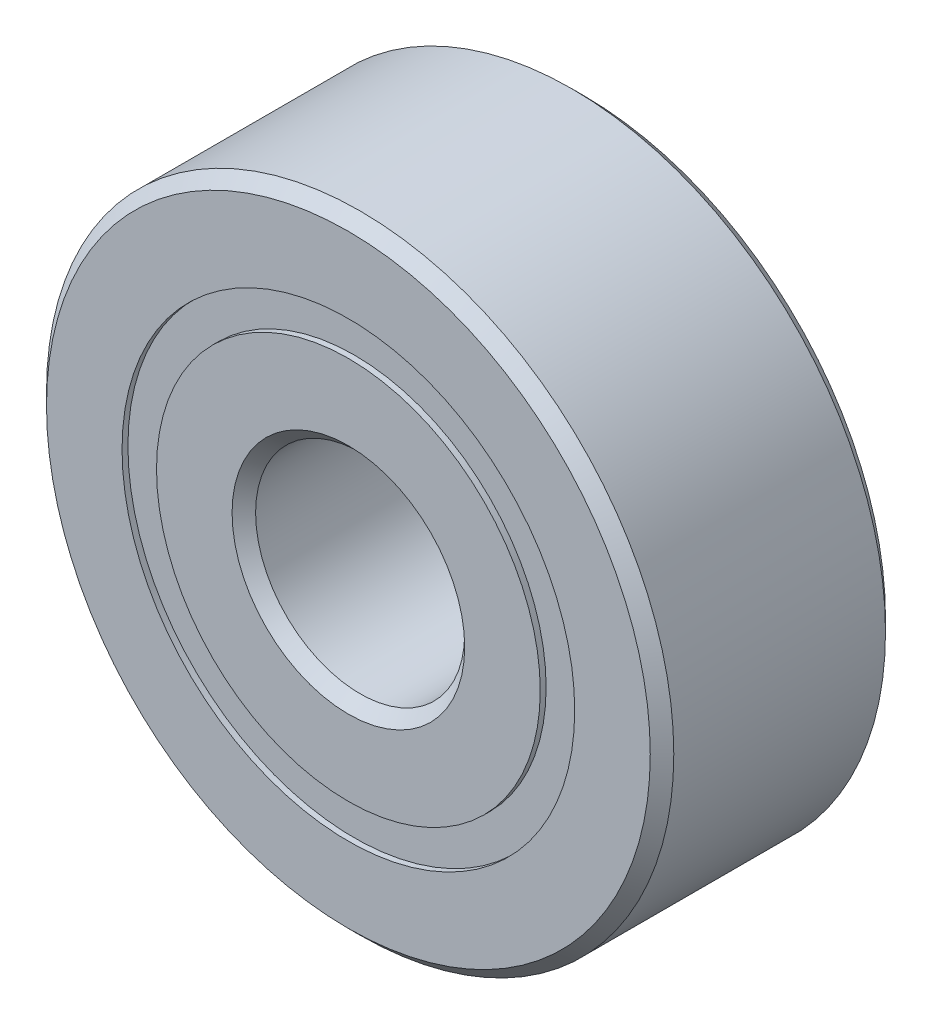
ISO-10303-21;
HEADER;
FILE_DESCRIPTION(('STEP AP214'),'2;1');
FILE_NAME('part.step','',(''),(''),'','','');
FILE_SCHEMA(('AUTOMOTIVE_DESIGN { 1 0 10303 214 1 1 1 1 }'));
ENDSEC;
DATA;
#1=APPLICATION_CONTEXT('core data for automotive mechanical design processes');
#2=APPLICATION_PROTOCOL_DEFINITION('international standard','automotive_design',2000,#1);
#3=PRODUCT_CONTEXT('',#1,'mechanical');
#4=PRODUCT('Part','Part','',(#3));
#5=PRODUCT_RELATED_PRODUCT_CATEGORY('part','',(#4));
#6=PRODUCT_DEFINITION_FORMATION('','',#4);
#7=PRODUCT_DEFINITION_CONTEXT('part definition',#1,'design');
#8=PRODUCT_DEFINITION('design','',#6,#7);
#9=PRODUCT_DEFINITION_SHAPE('','',#8);
#10=(LENGTH_UNIT() NAMED_UNIT(*) SI_UNIT(.MILLI.,.METRE.));
#11=(NAMED_UNIT(*) PLANE_ANGLE_UNIT() SI_UNIT($,.RADIAN.));
#12=(NAMED_UNIT(*) SI_UNIT($,.STERADIAN.) SOLID_ANGLE_UNIT());
#13=UNCERTAINTY_MEASURE_WITH_UNIT(LENGTH_MEASURE(1.E-05),#10,'distance_accuracy_value','');
#14=(GEOMETRIC_REPRESENTATION_CONTEXT(3) GLOBAL_UNCERTAINTY_ASSIGNED_CONTEXT((#13)) GLOBAL_UNIT_ASSIGNED_CONTEXT((#10,
#11,#12)) REPRESENTATION_CONTEXT('',''));
#15=CARTESIAN_POINT('',(0.,0.,0.));
#16=DIRECTION('',(0.,0.,1.));
#17=DIRECTION('',(1.,0.,0.));
#18=AXIS2_PLACEMENT_3D('',#15,#16,#17);
#19=CARTESIAN_POINT('',(0.,6.35,0.));
#20=DIRECTION('',(-1.,0.,0.));
#21=DIRECTION('',(0.,1.,0.));
#22=AXIS2_PLACEMENT_3D('',#19,#20,#21);
#23=SPHERICAL_SURFACE('',#22,1.67154216154795);
#24=CARTESIAN_POINT('',(0.,6.35,0.));
#25=DIRECTION('',(-1.,0.,0.));
#26=DIRECTION('',(0.,1.,0.));
#27=AXIS2_PLACEMENT_3D('',#24,#25,#26);
#28=CIRCLE('',#27,1.67154216154795);
#29=CARTESIAN_POINT('',(0.,5.82664835164835,-1.5875));
#30=VERTEX_POINT('',#29);
#31=CARTESIAN_POINT('',(0.,4.67845783845205,0.));
#32=VERTEX_POINT('',#31);
#33=EDGE_CURVE('P0_E18',#30,#32,#28,.T.);
#34=ORIENTED_EDGE('',*,*,#33,.T.);
#35=CARTESIAN_POINT('',(0.,6.35,0.));
#36=DIRECTION('',(0.,0.,1.));
#37=DIRECTION('',(0.,-1.,0.));
#38=AXIS2_PLACEMENT_3D('',#35,#36,#37);
#39=CIRCLE('',#38,1.67154216154795);
#40=CARTESIAN_POINT('',(-1.67154216154795,6.35,0.));
#41=VERTEX_POINT('',#40);
#42=EDGE_CURVE('P0_E62',#41,#32,#39,.T.);
#43=ORIENTED_EDGE('',*,*,#42,.F.);
#44=ORIENTED_EDGE('',*,*,#42,.T.);
#45=CARTESIAN_POINT('',(0.,6.35,0.));
#46=DIRECTION('',(-1.,0.,0.));
#47=DIRECTION('',(0.,1.,0.));
#48=AXIS2_PLACEMENT_3D('',#45,#46,#47);
#49=CIRCLE('',#48,1.67154216154795);
#50=CARTESIAN_POINT('',(0.,5.82664835164835,1.5875));
#51=VERTEX_POINT('',#50);
#52=EDGE_CURVE('P0_E25',#32,#51,#49,.T.);
#53=ORIENTED_EDGE('',*,*,#52,.T.);
#54=ORIENTED_EDGE('',*,*,#52,.F.);
#55=CARTESIAN_POINT('',(0.,6.35,0.));
#56=DIRECTION('',(0.,0.,1.));
#57=DIRECTION('',(0.,-1.,0.));
#58=AXIS2_PLACEMENT_3D('',#55,#56,#57);
#59=CIRCLE('',#58,1.67154216154795);
#60=CARTESIAN_POINT('',(1.67154216154795,6.35,0.));
#61=VERTEX_POINT('',#60);
#62=EDGE_CURVE('P0_E11',#32,#61,#59,.T.);
#63=ORIENTED_EDGE('',*,*,#62,.T.);
#64=ORIENTED_EDGE('',*,*,#62,.F.);
#65=ORIENTED_EDGE('',*,*,#33,.F.);
#66=EDGE_LOOP('',(#34,#43,#44,#53,#54,#63,#64,#65));
#67=FACE_BOUND('',#66,.T.);
#68=CARTESIAN_POINT('',(0.,6.35,0.));
#69=DIRECTION('',(-1.,0.,0.));
#70=DIRECTION('',(0.,1.,0.));
#71=AXIS2_PLACEMENT_3D('',#68,#69,#70);
#72=CIRCLE('',#71,1.67154216154795);
#73=CARTESIAN_POINT('',(0.,6.87335164835165,1.5875));
#74=VERTEX_POINT('',#73);
#75=CARTESIAN_POINT('',(0.,6.87335164835165,-1.5875));
#76=VERTEX_POINT('',#75);
#77=EDGE_CURVE('P0_E49',#74,#76,#72,.T.);
#78=ORIENTED_EDGE('',*,*,#77,.T.);
#79=ORIENTED_EDGE('',*,*,#77,.F.);
#80=EDGE_LOOP('',(#78,#79));
#81=FACE_BOUND('',#80,.T.);
#82=ADVANCED_FACE('P0_F16',(#67,#81),#23,.T.);
#83=CLOSED_SHELL('',(#82));
#84=MANIFOLD_SOLID_BREP('P0_B1',#83);
#85=CARTESIAN_POINT('',(0.,6.87335164835165,3.39328125));
#86=DIRECTION('',(0.,0.,-1.));
#87=DIRECTION('',(0.,-1.,0.));
#88=AXIS2_PLACEMENT_3D('',#85,#86,#87);
#89=PLANE('',#88);
#90=CARTESIAN_POINT('',(0.,0.,3.39328125));
#91=DIRECTION('',(0.,0.,-1.));
#92=DIRECTION('',(1.,0.,0.));
#93=AXIS2_PLACEMENT_3D('',#90,#91,#92);
#94=CIRCLE('',#93,6.87335164835165);
#95=CARTESIAN_POINT('',(6.87335164835165,0.,3.39328125));
#96=VERTEX_POINT('',#95);
#97=CARTESIAN_POINT('',(-6.87335164835165,0.,3.39328125));
#98=VERTEX_POINT('',#97);
#99=EDGE_CURVE('P1_E41',#96,#98,#94,.T.);
#100=ORIENTED_EDGE('',*,*,#99,.F.);
#101=CARTESIAN_POINT('',(0.,0.,3.39328125));
#102=DIRECTION('',(0.,0.,-1.));
#103=DIRECTION('',(1.,0.,0.));
#104=AXIS2_PLACEMENT_3D('',#101,#102,#103);
#105=CIRCLE('',#104,6.87335164835165);
#106=EDGE_CURVE('P1_E21',#98,#96,#105,.T.);
#107=ORIENTED_EDGE('',*,*,#106,.F.);
#108=EDGE_LOOP('',(#100,#107));
#109=FACE_BOUND('',#108,.T.);
#110=CARTESIAN_POINT('',(0.,0.,3.39328125));
#111=DIRECTION('',(0.,0.,1.));
#112=DIRECTION('',(1.,0.,0.));
#113=AXIS2_PLACEMENT_3D('',#110,#111,#112);
#114=CIRCLE('',#113,5.82664835164835);
#115=CARTESIAN_POINT('',(5.82664835164835,0.,3.39328125));
#116=VERTEX_POINT('',#115);
#117=CARTESIAN_POINT('',(-5.82664835164835,0.,3.39328125));
#118=VERTEX_POINT('',#117);
#119=EDGE_CURVE('P1_E279',#116,#118,#114,.T.);
#120=ORIENTED_EDGE('',*,*,#119,.F.);
#121=CARTESIAN_POINT('',(0.,0.,3.39328125));
#122=DIRECTION('',(0.,0.,1.));
#123=DIRECTION('',(1.,0.,0.));
#124=AXIS2_PLACEMENT_3D('',#121,#122,#123);
#125=CIRCLE('',#124,5.82664835164835);
#126=EDGE_CURVE('P1_E276',#118,#116,#125,.T.);
#127=ORIENTED_EDGE('',*,*,#126,.F.);
#128=EDGE_LOOP('',(#120,#127));
#129=FACE_BOUND('',#128,.T.);
#130=ADVANCED_FACE('P1_F17',(#109,#129),#89,.F.);
#131=CARTESIAN_POINT('',(0.,6.87335164835165,-3.39328125));
#132=DIRECTION('',(0.,0.,1.));
#133=DIRECTION('',(1.,0.,0.));
#134=AXIS2_PLACEMENT_3D('',#131,#132,#133);
#135=PLANE('',#134);
#136=CARTESIAN_POINT('',(0.,0.,-3.39328125));
#137=DIRECTION('',(0.,0.,1.));
#138=DIRECTION('',(1.,0.,0.));
#139=AXIS2_PLACEMENT_3D('',#136,#137,#138);
#140=CIRCLE('',#139,6.87335164835165);
#141=CARTESIAN_POINT('',(6.87335164835165,0.,-3.39328125));
#142=VERTEX_POINT('',#141);
#143=CARTESIAN_POINT('',(-6.87335164835165,0.,-3.39328125));
#144=VERTEX_POINT('',#143);
#145=EDGE_CURVE('P1_E298',#142,#144,#140,.T.);
#146=ORIENTED_EDGE('',*,*,#145,.F.);
#147=CARTESIAN_POINT('',(0.,0.,-3.39328125));
#148=DIRECTION('',(0.,0.,1.));
#149=DIRECTION('',(1.,0.,0.));
#150=AXIS2_PLACEMENT_3D('',#147,#148,#149);
#151=CIRCLE('',#150,6.87335164835165);
#152=EDGE_CURVE('P1_E351',#144,#142,#151,.T.);
#153=ORIENTED_EDGE('',*,*,#152,.F.);
#154=EDGE_LOOP('',(#146,#153));
#155=FACE_BOUND('',#154,.T.);
#156=CARTESIAN_POINT('',(0.,0.,-3.39328125));
#157=DIRECTION('',(0.,0.,-1.));
#158=DIRECTION('',(1.,0.,0.));
#159=AXIS2_PLACEMENT_3D('',#156,#157,#158);
#160=CIRCLE('',#159,5.82664835164835);
#161=CARTESIAN_POINT('',(5.82664835164835,0.,-3.39328125));
#162=VERTEX_POINT('',#161);
#163=CARTESIAN_POINT('',(-5.82664835164835,0.,-3.39328125));
#164=VERTEX_POINT('',#163);
#165=EDGE_CURVE('P1_E382',#162,#164,#160,.T.);
#166=ORIENTED_EDGE('',*,*,#165,.F.);
#167=CARTESIAN_POINT('',(0.,0.,-3.39328125));
#168=DIRECTION('',(0.,0.,-1.));
#169=DIRECTION('',(1.,0.,0.));
#170=AXIS2_PLACEMENT_3D('',#167,#168,#169);
#171=CIRCLE('',#170,5.82664835164835);
#172=EDGE_CURVE('P1_E271',#164,#162,#171,.T.);
#173=ORIENTED_EDGE('',*,*,#172,.F.);
#174=EDGE_LOOP('',(#166,#173));
#175=FACE_BOUND('',#174,.T.);
#176=ADVANCED_FACE('P1_F566',(#155,#175),#135,.F.);
#177=CARTESIAN_POINT('',(0.,0.,3.571875));
#178=DIRECTION('',(0.,0.,1.));
#179=DIRECTION('',(1.,0.,0.));
#180=AXIS2_PLACEMENT_3D('',#177,#178,#179);
#181=CONICAL_SURFACE('',#180,3.5321875,0.78539816339745);
#182=CARTESIAN_POINT('',(0.,0.,3.2146875));
#183=DIRECTION('',(0.,0.,1.));
#184=DIRECTION('',(1.,0.,0.));
#185=AXIS2_PLACEMENT_3D('',#182,#183,#184);
#186=CIRCLE('',#185,3.175);
#187=CARTESIAN_POINT('',(3.175,0.,3.2146875));
#188=VERTEX_POINT('',#187);
#189=CARTESIAN_POINT('',(-3.175,0.,3.2146875));
#190=VERTEX_POINT('',#189);
#191=EDGE_CURVE('P1_E337',#188,#190,#186,.T.);
#192=ORIENTED_EDGE('',*,*,#191,.F.);
#193=CARTESIAN_POINT('',(0.,0.,3.2146875));
#194=DIRECTION('',(0.,0.,1.));
#195=DIRECTION('',(1.,0.,0.));
#196=AXIS2_PLACEMENT_3D('',#193,#194,#195);
#197=CIRCLE('',#196,3.175);
#198=EDGE_CURVE('P1_E340',#190,#188,#197,.T.);
#199=ORIENTED_EDGE('',*,*,#198,.F.);
#200=DIRECTION('',(-0.707106781186549,0.,0.707106781186546));
#201=VECTOR('',#200,1.);
#202=CARTESIAN_POINT('',(-3.5321875,0.,3.571875));
#203=LINE('',#202,#201);
#204=CARTESIAN_POINT('',(-3.5321875,0.,3.571875));
#205=VERTEX_POINT('',#204);
#206=EDGE_CURVE('P1_E11',#190,#205,#203,.T.);
#207=ORIENTED_EDGE('',*,*,#206,.T.);
#208=CARTESIAN_POINT('',(0.,0.,3.571875));
#209=DIRECTION('',(0.,0.,1.));
#210=DIRECTION('',(1.,0.,0.));
#211=AXIS2_PLACEMENT_3D('',#208,#209,#210);
#212=CIRCLE('',#211,3.5321875);
#213=CARTESIAN_POINT('',(3.5321875,0.,3.571875));
#214=VERTEX_POINT('',#213);
#215=EDGE_CURVE('P1_E28',#205,#214,#212,.T.);
#216=ORIENTED_EDGE('',*,*,#215,.T.);
#217=CARTESIAN_POINT('',(0.,0.,3.571875));
#218=DIRECTION('',(0.,0.,1.));
#219=DIRECTION('',(1.,0.,0.));
#220=AXIS2_PLACEMENT_3D('',#217,#218,#219);
#221=CIRCLE('',#220,3.5321875);
#222=EDGE_CURVE('P1_E445',#214,#205,#221,.T.);
#223=ORIENTED_EDGE('',*,*,#222,.T.);
#224=ORIENTED_EDGE('',*,*,#206,.F.);
#225=EDGE_LOOP('',(#192,#199,#207,#216,#223,#224));
#226=FACE_BOUND('',#225,.T.);
#227=ADVANCED_FACE('P1_F580',(#226),#181,.F.);
#228=CARTESIAN_POINT('',(0.,0.,3.571875));
#229=DIRECTION('',(0.,0.,1.));
#230=DIRECTION('',(1.,0.,0.));
#231=AXIS2_PLACEMENT_3D('',#228,#229,#230);
#232=CYLINDRICAL_SURFACE('',#231,3.175);
#233=CARTESIAN_POINT('',(0.,0.,-3.2146875));
#234=DIRECTION('',(0.,0.,1.));
#235=DIRECTION('',(1.,0.,0.));
#236=AXIS2_PLACEMENT_3D('',#233,#234,#235);
#237=CIRCLE('',#236,3.175);
#238=CARTESIAN_POINT('',(3.175,0.,-3.2146875));
#239=VERTEX_POINT('',#238);
#240=CARTESIAN_POINT('',(-3.175,0.,-3.2146875));
#241=VERTEX_POINT('',#240);
#242=EDGE_CURVE('P1_E341',#239,#241,#237,.T.);
#243=ORIENTED_EDGE('',*,*,#242,.F.);
#244=CARTESIAN_POINT('',(0.,0.,-3.2146875));
#245=DIRECTION('',(0.,0.,1.));
#246=DIRECTION('',(1.,0.,0.));
#247=AXIS2_PLACEMENT_3D('',#244,#245,#246);
#248=CIRCLE('',#247,3.175);
#249=EDGE_CURVE('P1_E352',#241,#239,#248,.T.);
#250=ORIENTED_EDGE('',*,*,#249,.F.);
#251=DIRECTION('',(0.,0.,1.));
#252=VECTOR('',#251,1.);
#253=CARTESIAN_POINT('',(-3.175,0.,3.571875));
#254=LINE('',#253,#252);
#255=EDGE_CURVE('P1_E459',#241,#190,#254,.T.);
#256=ORIENTED_EDGE('',*,*,#255,.T.);
#257=ORIENTED_EDGE('',*,*,#198,.T.);
#258=ORIENTED_EDGE('',*,*,#191,.T.);
#259=ORIENTED_EDGE('',*,*,#255,.F.);
#260=EDGE_LOOP('',(#243,#250,#256,#257,#258,#259));
#261=FACE_BOUND('',#260,.T.);
#262=ADVANCED_FACE('P1_F573',(#261),#232,.F.);
#263=CARTESIAN_POINT('',(0.,0.,-3.2146875));
#264=DIRECTION('',(0.,0.,-1.));
#265=DIRECTION('',(-1.,0.,0.));
#266=AXIS2_PLACEMENT_3D('',#263,#264,#265);
#267=CONICAL_SURFACE('',#266,3.175,0.785398163397446);
#268=ORIENTED_EDGE('',*,*,#242,.T.);
#269=ORIENTED_EDGE('',*,*,#249,.T.);
#270=DIRECTION('',(0.707106781186546,0.,-0.707106781186549));
#271=VECTOR('',#270,1.);
#272=CARTESIAN_POINT('',(3.175,0.,-3.2146875));
#273=LINE('',#272,#271);
#274=CARTESIAN_POINT('',(3.5321875,0.,-3.571875));
#275=VERTEX_POINT('',#274);
#276=EDGE_CURVE('P1_E355',#239,#275,#273,.T.);
#277=ORIENTED_EDGE('',*,*,#276,.T.);
#278=CARTESIAN_POINT('',(0.,0.,-3.571875));
#279=DIRECTION('',(0.,0.,1.));
#280=DIRECTION('',(1.,0.,0.));
#281=AXIS2_PLACEMENT_3D('',#278,#279,#280);
#282=CIRCLE('',#281,3.5321875);
#283=CARTESIAN_POINT('',(-3.5321875,0.,-3.571875));
#284=VERTEX_POINT('',#283);
#285=EDGE_CURVE('P1_E365',#284,#275,#282,.T.);
#286=ORIENTED_EDGE('',*,*,#285,.F.);
#287=CARTESIAN_POINT('',(0.,0.,-3.571875));
#288=DIRECTION('',(0.,0.,1.));
#289=DIRECTION('',(1.,0.,0.));
#290=AXIS2_PLACEMENT_3D('',#287,#288,#289);
#291=CIRCLE('',#290,3.5321875);
#292=EDGE_CURVE('P1_E378',#275,#284,#291,.T.);
#293=ORIENTED_EDGE('',*,*,#292,.F.);
#294=ORIENTED_EDGE('',*,*,#276,.F.);
#295=EDGE_LOOP('',(#268,#269,#277,#286,#293,#294));
#296=FACE_BOUND('',#295,.T.);
#297=ADVANCED_FACE('P1_F570',(#296),#267,.F.);
#298=CARTESIAN_POINT('',(0.,0.,3.571875));
#299=DIRECTION('',(0.,0.,1.));
#300=DIRECTION('',(1.,0.,0.));
#301=AXIS2_PLACEMENT_3D('',#298,#299,#300);
#302=CYLINDRICAL_SURFACE('',#301,5.82664835164835);
#303=ORIENTED_EDGE('',*,*,#165,.T.);
#304=DIRECTION('',(0.,0.,-1.));
#305=VECTOR('',#304,1.);
#306=CARTESIAN_POINT('',(-5.82664835164835,0.,3.571875));
#307=LINE('',#306,#305);
#308=CARTESIAN_POINT('',(-5.82664835164835,0.,-3.571875));
#309=VERTEX_POINT('',#308);
#310=EDGE_CURVE('P1_E306',#164,#309,#307,.T.);
#311=ORIENTED_EDGE('',*,*,#310,.T.);
#312=CARTESIAN_POINT('',(0.,0.,-3.571875));
#313=DIRECTION('',(0.,0.,1.));
#314=DIRECTION('',(1.,0.,0.));
#315=AXIS2_PLACEMENT_3D('',#312,#313,#314);
#316=CIRCLE('',#315,5.82664835164835);
#317=CARTESIAN_POINT('',(5.82664835164835,0.,-3.571875));
#318=VERTEX_POINT('',#317);
#319=EDGE_CURVE('P1_E303',#309,#318,#316,.T.);
#320=ORIENTED_EDGE('',*,*,#319,.T.);
#321=CARTESIAN_POINT('',(0.,0.,-3.571875));
#322=DIRECTION('',(0.,0.,1.));
#323=DIRECTION('',(1.,0.,0.));
#324=AXIS2_PLACEMENT_3D('',#321,#322,#323);
#325=CIRCLE('',#324,5.82664835164835);
#326=EDGE_CURVE('P1_E307',#318,#309,#325,.T.);
#327=ORIENTED_EDGE('',*,*,#326,.T.);
#328=ORIENTED_EDGE('',*,*,#310,.F.);
#329=ORIENTED_EDGE('',*,*,#172,.T.);
#330=EDGE_LOOP('',(#303,#311,#320,#327,#328,#329));
#331=FACE_BOUND('',#330,.T.);
#332=ADVANCED_FACE('P1_F572',(#331),#302,.T.);
#333=CARTESIAN_POINT('',(0.,0.,3.571875));
#334=DIRECTION('',(0.,0.,1.));
#335=DIRECTION('',(1.,0.,0.));
#336=AXIS2_PLACEMENT_3D('',#333,#334,#335);
#337=CYLINDRICAL_SURFACE('',#336,5.82664835164835);
#338=CARTESIAN_POINT('',(0.,0.,3.571875));
#339=DIRECTION('',(0.,0.,1.));
#340=DIRECTION('',(1.,0.,0.));
#341=AXIS2_PLACEMENT_3D('',#338,#339,#340);
#342=CIRCLE('',#341,5.82664835164835);
#343=CARTESIAN_POINT('',(5.82664835164835,0.,3.571875));
#344=VERTEX_POINT('',#343);
#345=CARTESIAN_POINT('',(-5.82664835164835,0.,3.571875));
#346=VERTEX_POINT('',#345);
#347=EDGE_CURVE('P1_E330',#344,#346,#342,.T.);
#348=ORIENTED_EDGE('',*,*,#347,.F.);
#349=CARTESIAN_POINT('',(0.,0.,3.571875));
#350=DIRECTION('',(0.,0.,1.));
#351=DIRECTION('',(1.,0.,0.));
#352=AXIS2_PLACEMENT_3D('',#349,#350,#351);
#353=CIRCLE('',#352,5.82664835164835);
#354=EDGE_CURVE('P1_E345',#346,#344,#353,.T.);
#355=ORIENTED_EDGE('',*,*,#354,.F.);
#356=DIRECTION('',(0.,0.,-1.));
#357=VECTOR('',#356,1.);
#358=CARTESIAN_POINT('',(-5.82664835164835,0.,3.571875));
#359=LINE('',#358,#357);
#360=EDGE_CURVE('P1_E273',#346,#118,#359,.T.);
#361=ORIENTED_EDGE('',*,*,#360,.T.);
#362=ORIENTED_EDGE('',*,*,#126,.T.);
#363=ORIENTED_EDGE('',*,*,#119,.T.);
#364=ORIENTED_EDGE('',*,*,#360,.F.);
#365=EDGE_LOOP('',(#348,#355,#361,#362,#363,#364));
#366=FACE_BOUND('',#365,.T.);
#367=ADVANCED_FACE('P1_F542',(#366),#337,.T.);
#368=CARTESIAN_POINT('',(0.,5.82664835164835,3.571875));
#369=DIRECTION('',(0.,0.,-1.));
#370=DIRECTION('',(0.,-1.,0.));
#371=AXIS2_PLACEMENT_3D('',#368,#369,#370);
#372=PLANE('',#371);
#373=ORIENTED_EDGE('',*,*,#347,.T.);
#374=ORIENTED_EDGE('',*,*,#354,.T.);
#375=EDGE_LOOP('',(#373,#374));
#376=FACE_BOUND('',#375,.T.);
#377=ORIENTED_EDGE('',*,*,#222,.F.);
#378=ORIENTED_EDGE('',*,*,#215,.F.);
#379=EDGE_LOOP('',(#377,#378));
#380=FACE_BOUND('',#379,.T.);
#381=ADVANCED_FACE('P1_F538',(#376,#380),#372,.F.);
#382=CARTESIAN_POINT('',(0.,3.5321875,-3.571875));
#383=DIRECTION('',(0.,0.,1.));
#384=DIRECTION('',(1.,0.,0.));
#385=AXIS2_PLACEMENT_3D('',#382,#383,#384);
#386=PLANE('',#385);
#387=ORIENTED_EDGE('',*,*,#326,.F.);
#388=ORIENTED_EDGE('',*,*,#319,.F.);
#389=EDGE_LOOP('',(#387,#388));
#390=FACE_BOUND('',#389,.T.);
#391=ORIENTED_EDGE('',*,*,#285,.T.);
#392=ORIENTED_EDGE('',*,*,#292,.T.);
#393=EDGE_LOOP('',(#391,#392));
#394=FACE_BOUND('',#393,.T.);
#395=ADVANCED_FACE('P1_F541',(#390,#394),#386,.F.);
#396=CARTESIAN_POINT('',(0.,0.,3.571875));
#397=DIRECTION('',(0.,0.,1.));
#398=DIRECTION('',(1.,0.,0.));
#399=AXIS2_PLACEMENT_3D('',#396,#397,#398);
#400=CYLINDRICAL_SURFACE('',#399,6.87335164835165);
#401=ORIENTED_EDGE('',*,*,#99,.T.);
#402=DIRECTION('',(0.,0.,1.));
#403=VECTOR('',#402,1.);
#404=CARTESIAN_POINT('',(-6.87335164835165,0.,3.571875));
#405=LINE('',#404,#403);
#406=CARTESIAN_POINT('',(-6.87335164835165,0.,3.571875));
#407=VERTEX_POINT('',#406);
#408=EDGE_CURVE('P1_E320',#98,#407,#405,.T.);
#409=ORIENTED_EDGE('',*,*,#408,.T.);
#410=CARTESIAN_POINT('',(0.,0.,3.571875));
#411=DIRECTION('',(0.,0.,1.));
#412=DIRECTION('',(1.,0.,0.));
#413=AXIS2_PLACEMENT_3D('',#410,#411,#412);
#414=CIRCLE('',#413,6.87335164835165);
#415=CARTESIAN_POINT('',(6.87335164835165,0.,3.571875));
#416=VERTEX_POINT('',#415);
#417=EDGE_CURVE('P1_E145',#407,#416,#414,.T.);
#418=ORIENTED_EDGE('',*,*,#417,.T.);
#419=CARTESIAN_POINT('',(0.,0.,3.571875));
#420=DIRECTION('',(0.,0.,1.));
#421=DIRECTION('',(1.,0.,0.));
#422=AXIS2_PLACEMENT_3D('',#419,#420,#421);
#423=CIRCLE('',#422,6.87335164835165);
#424=EDGE_CURVE('P1_E371',#416,#407,#423,.T.);
#425=ORIENTED_EDGE('',*,*,#424,.T.);
#426=ORIENTED_EDGE('',*,*,#408,.F.);
#427=ORIENTED_EDGE('',*,*,#106,.T.);
#428=EDGE_LOOP('',(#401,#409,#418,#425,#426,#427));
#429=FACE_BOUND('',#428,.T.);
#430=ADVANCED_FACE('P1_F554',(#429),#400,.F.);
#431=CARTESIAN_POINT('',(0.,0.,3.571875));
#432=DIRECTION('',(0.,0.,1.));
#433=DIRECTION('',(1.,0.,0.));
#434=AXIS2_PLACEMENT_3D('',#431,#432,#433);
#435=CYLINDRICAL_SURFACE('',#434,6.87335164835165);
#436=CARTESIAN_POINT('',(0.,0.,-3.571875));
#437=DIRECTION('',(0.,0.,1.));
#438=DIRECTION('',(1.,0.,0.));
#439=AXIS2_PLACEMENT_3D('',#436,#437,#438);
#440=CIRCLE('',#439,6.87335164835165);
#441=CARTESIAN_POINT('',(6.87335164835165,0.,-3.571875));
#442=VERTEX_POINT('',#441);
#443=CARTESIAN_POINT('',(-6.87335164835165,0.,-3.571875));
#444=VERTEX_POINT('',#443);
#445=EDGE_CURVE('P1_E156',#442,#444,#440,.T.);
#446=ORIENTED_EDGE('',*,*,#445,.F.);
#447=CARTESIAN_POINT('',(0.,0.,-3.571875));
#448=DIRECTION('',(0.,0.,1.));
#449=DIRECTION('',(1.,0.,0.));
#450=AXIS2_PLACEMENT_3D('',#447,#448,#449);
#451=CIRCLE('',#450,6.87335164835165);
#452=EDGE_CURVE('P1_E411',#444,#442,#451,.T.);
#453=ORIENTED_EDGE('',*,*,#452,.F.);
#454=DIRECTION('',(0.,0.,1.));
#455=VECTOR('',#454,1.);
#456=CARTESIAN_POINT('',(-6.87335164835165,0.,3.571875));
#457=LINE('',#456,#455);
#458=EDGE_CURVE('P1_E405',#444,#144,#457,.T.);
#459=ORIENTED_EDGE('',*,*,#458,.T.);
#460=ORIENTED_EDGE('',*,*,#152,.T.);
#461=ORIENTED_EDGE('',*,*,#145,.T.);
#462=ORIENTED_EDGE('',*,*,#458,.F.);
#463=EDGE_LOOP('',(#446,#453,#459,#460,#461,#462));
#464=FACE_BOUND('',#463,.T.);
#465=ADVANCED_FACE('P1_F435',(#464),#435,.F.);
#466=CARTESIAN_POINT('',(0.,0.,-3.571875));
#467=DIRECTION('',(0.,0.,1.));
#468=DIRECTION('',(1.,0.,0.));
#469=AXIS2_PLACEMENT_3D('',#466,#467,#468);
#470=CONICAL_SURFACE('',#469,9.1678125,0.785398163397446);
#471=CARTESIAN_POINT('',(0.,0.,-3.2146875));
#472=DIRECTION('',(0.,0.,1.));
#473=DIRECTION('',(1.,0.,0.));
#474=AXIS2_PLACEMENT_3D('',#471,#472,#473);
#475=CIRCLE('',#474,9.525);
#476=CARTESIAN_POINT('',(9.525,0.,-3.2146875));
#477=VERTEX_POINT('',#476);
#478=CARTESIAN_POINT('',(-9.525,0.,-3.2146875));
#479=VERTEX_POINT('',#478);
#480=EDGE_CURVE('P1_E316',#477,#479,#475,.T.);
#481=ORIENTED_EDGE('',*,*,#480,.F.);
#482=CARTESIAN_POINT('',(0.,0.,-3.2146875));
#483=DIRECTION('',(0.,0.,1.));
#484=DIRECTION('',(1.,0.,0.));
#485=AXIS2_PLACEMENT_3D('',#482,#483,#484);
#486=CIRCLE('',#485,9.525);
#487=EDGE_CURVE('P1_E311',#479,#477,#486,.T.);
#488=ORIENTED_EDGE('',*,*,#487,.F.);
#489=DIRECTION('',(0.707106781186546,0.,-0.707106781186549));
#490=VECTOR('',#489,1.);
#491=CARTESIAN_POINT('',(-9.1678125,0.,-3.571875));
#492=LINE('',#491,#490);
#493=CARTESIAN_POINT('',(-9.1678125,0.,-3.571875));
#494=VERTEX_POINT('',#493);
#495=EDGE_CURVE('P1_E294',#479,#494,#492,.T.);
#496=ORIENTED_EDGE('',*,*,#495,.T.);
#497=CARTESIAN_POINT('',(0.,0.,-3.571875));
#498=DIRECTION('',(0.,0.,1.));
#499=DIRECTION('',(1.,0.,0.));
#500=AXIS2_PLACEMENT_3D('',#497,#498,#499);
#501=CIRCLE('',#500,9.1678125);
#502=CARTESIAN_POINT('',(9.1678125,0.,-3.571875));
#503=VERTEX_POINT('',#502);
#504=EDGE_CURVE('P1_E299',#494,#503,#501,.T.);
#505=ORIENTED_EDGE('',*,*,#504,.T.);
#506=CARTESIAN_POINT('',(0.,0.,-3.571875));
#507=DIRECTION('',(0.,0.,1.));
#508=DIRECTION('',(1.,0.,0.));
#509=AXIS2_PLACEMENT_3D('',#506,#507,#508);
#510=CIRCLE('',#509,9.1678125);
#511=EDGE_CURVE('P1_E302',#503,#494,#510,.T.);
#512=ORIENTED_EDGE('',*,*,#511,.T.);
#513=ORIENTED_EDGE('',*,*,#495,.F.);
#514=EDGE_LOOP('',(#481,#488,#496,#505,#512,#513));
#515=FACE_BOUND('',#514,.T.);
#516=ADVANCED_FACE('P1_F546',(#515),#470,.T.);
#517=CARTESIAN_POINT('',(0.,0.,3.571875));
#518=DIRECTION('',(0.,0.,1.));
#519=DIRECTION('',(1.,0.,0.));
#520=AXIS2_PLACEMENT_3D('',#517,#518,#519);
#521=CYLINDRICAL_SURFACE('',#520,9.525);
#522=CARTESIAN_POINT('',(0.,0.,3.2146875));
#523=DIRECTION('',(0.,0.,1.));
#524=DIRECTION('',(1.,0.,0.));
#525=AXIS2_PLACEMENT_3D('',#522,#523,#524);
#526=CIRCLE('',#525,9.525);
#527=CARTESIAN_POINT('',(9.525,0.,3.2146875));
#528=VERTEX_POINT('',#527);
#529=CARTESIAN_POINT('',(-9.525,0.,3.2146875));
#530=VERTEX_POINT('',#529);
#531=EDGE_CURVE('P1_E396',#528,#530,#526,.T.);
#532=ORIENTED_EDGE('',*,*,#531,.F.);
#533=CARTESIAN_POINT('',(0.,0.,3.2146875));
#534=DIRECTION('',(0.,0.,1.));
#535=DIRECTION('',(1.,0.,0.));
#536=AXIS2_PLACEMENT_3D('',#533,#534,#535);
#537=CIRCLE('',#536,9.525);
#538=EDGE_CURVE('P1_E293',#530,#528,#537,.T.);
#539=ORIENTED_EDGE('',*,*,#538,.F.);
#540=DIRECTION('',(0.,0.,-1.));
#541=VECTOR('',#540,1.);
#542=CARTESIAN_POINT('',(-9.525,0.,3.571875));
#543=LINE('',#542,#541);
#544=EDGE_CURVE('P1_E315',#530,#479,#543,.T.);
#545=ORIENTED_EDGE('',*,*,#544,.T.);
#546=ORIENTED_EDGE('',*,*,#487,.T.);
#547=ORIENTED_EDGE('',*,*,#480,.T.);
#548=ORIENTED_EDGE('',*,*,#544,.F.);
#549=EDGE_LOOP('',(#532,#539,#545,#546,#547,#548));
#550=FACE_BOUND('',#549,.T.);
#551=ADVANCED_FACE('P1_F544',(#550),#521,.T.);
#552=CARTESIAN_POINT('',(0.,0.,3.2146875));
#553=DIRECTION('',(0.,0.,-1.));
#554=DIRECTION('',(-1.,0.,0.));
#555=AXIS2_PLACEMENT_3D('',#552,#553,#554);
#556=CONICAL_SURFACE('',#555,9.525,0.785398163397448);
#557=ORIENTED_EDGE('',*,*,#531,.T.);
#558=ORIENTED_EDGE('',*,*,#538,.T.);
#559=DIRECTION('',(-0.707106781186548,0.,0.707106781186548));
#560=VECTOR('',#559,1.);
#561=CARTESIAN_POINT('',(9.525,0.,3.2146875));
#562=LINE('',#561,#560);
#563=CARTESIAN_POINT('',(9.1678125,0.,3.571875));
#564=VERTEX_POINT('',#563);
#565=EDGE_CURVE('P1_E289',#528,#564,#562,.T.);
#566=ORIENTED_EDGE('',*,*,#565,.T.);
#567=CARTESIAN_POINT('',(0.,0.,3.571875));
#568=DIRECTION('',(0.,0.,1.));
#569=DIRECTION('',(1.,0.,0.));
#570=AXIS2_PLACEMENT_3D('',#567,#568,#569);
#571=CIRCLE('',#570,9.1678125);
#572=CARTESIAN_POINT('',(-9.1678125,0.,3.571875));
#573=VERTEX_POINT('',#572);
#574=EDGE_CURVE('P1_E414',#573,#564,#571,.T.);
#575=ORIENTED_EDGE('',*,*,#574,.F.);
#576=CARTESIAN_POINT('',(0.,0.,3.571875));
#577=DIRECTION('',(0.,0.,1.));
#578=DIRECTION('',(1.,0.,0.));
#579=AXIS2_PLACEMENT_3D('',#576,#577,#578);
#580=CIRCLE('',#579,9.1678125);
#581=EDGE_CURVE('P1_E375',#564,#573,#580,.T.);
#582=ORIENTED_EDGE('',*,*,#581,.F.);
#583=ORIENTED_EDGE('',*,*,#565,.F.);
#584=EDGE_LOOP('',(#557,#558,#566,#575,#582,#583));
#585=FACE_BOUND('',#584,.T.);
#586=ADVANCED_FACE('P1_F536',(#585),#556,.T.);
#587=CARTESIAN_POINT('',(0.,9.1678125,-3.571875));
#588=DIRECTION('',(0.,0.,1.));
#589=DIRECTION('',(1.,0.,0.));
#590=AXIS2_PLACEMENT_3D('',#587,#588,#589);
#591=PLANE('',#590);
#592=ORIENTED_EDGE('',*,*,#511,.F.);
#593=ORIENTED_EDGE('',*,*,#504,.F.);
#594=EDGE_LOOP('',(#592,#593));
#595=FACE_BOUND('',#594,.T.);
#596=ORIENTED_EDGE('',*,*,#445,.T.);
#597=ORIENTED_EDGE('',*,*,#452,.T.);
#598=EDGE_LOOP('',(#596,#597));
#599=FACE_BOUND('',#598,.T.);
#600=ADVANCED_FACE('P1_F433',(#595,#599),#591,.F.);
#601=CARTESIAN_POINT('',(0.,9.1678125,3.571875));
#602=DIRECTION('',(0.,0.,-1.));
#603=DIRECTION('',(0.,-1.,0.));
#604=AXIS2_PLACEMENT_3D('',#601,#602,#603);
#605=PLANE('',#604);
#606=ORIENTED_EDGE('',*,*,#574,.T.);
#607=ORIENTED_EDGE('',*,*,#581,.T.);
#608=EDGE_LOOP('',(#606,#607));
#609=FACE_BOUND('',#608,.T.);
#610=ORIENTED_EDGE('',*,*,#424,.F.);
#611=ORIENTED_EDGE('',*,*,#417,.F.);
#612=EDGE_LOOP('',(#610,#611));
#613=FACE_BOUND('',#612,.T.);
#614=ADVANCED_FACE('P1_F535',(#609,#613),#605,.F.);
#615=CLOSED_SHELL('',(#130,#176,#227,#262,#297,#332,#367,#381,#395,#430,#465,#516,#551,#586,
#600,#614));
#616=CARTESIAN_POINT('',(0.,6.87335164835165,1.67154216154795));
#617=DIRECTION('',(0.,0.,1.));
#618=DIRECTION('',(1.,0.,0.));
#619=AXIS2_PLACEMENT_3D('',#616,#617,#618);
#620=PLANE('',#619);
#621=CARTESIAN_POINT('',(0.,0.,1.67154216154795));
#622=DIRECTION('',(0.,0.,1.));
#623=DIRECTION('',(1.,0.,0.));
#624=AXIS2_PLACEMENT_3D('',#621,#622,#623);
#625=CIRCLE('',#624,6.87335164835165);
#626=CARTESIAN_POINT('',(-6.87335164835165,0.,1.67154216154795));
#627=VERTEX_POINT('',#626);
#628=CARTESIAN_POINT('',(6.87335164835165,0.,1.67154216154795));
#629=VERTEX_POINT('',#628);
#630=EDGE_CURVE('P1_E389',#627,#629,#625,.T.);
#631=ORIENTED_EDGE('',*,*,#630,.F.);
#632=CARTESIAN_POINT('',(0.,0.,1.67154216154795));
#633=DIRECTION('',(0.,0.,1.));
#634=DIRECTION('',(1.,0.,0.));
#635=AXIS2_PLACEMENT_3D('',#632,#633,#634);
#636=CIRCLE('',#635,6.87335164835165);
#637=EDGE_CURVE('P1_E393',#629,#627,#636,.T.);
#638=ORIENTED_EDGE('',*,*,#637,.F.);
#639=EDGE_LOOP('',(#631,#638));
#640=FACE_BOUND('',#639,.T.);
#641=CARTESIAN_POINT('',(0.,0.,1.67154216154795));
#642=DIRECTION('',(0.,0.,-1.));
#643=DIRECTION('',(1.,0.,0.));
#644=AXIS2_PLACEMENT_3D('',#641,#642,#643);
#645=CIRCLE('',#644,5.82664835164835);
#646=CARTESIAN_POINT('',(-5.82664835164835,0.,1.67154216154795));
#647=VERTEX_POINT('',#646);
#648=CARTESIAN_POINT('',(5.82664835164835,0.,1.67154216154795));
#649=VERTEX_POINT('',#648);
#650=EDGE_CURVE('P1_E446',#647,#649,#645,.T.);
#651=ORIENTED_EDGE('',*,*,#650,.F.);
#652=CARTESIAN_POINT('',(0.,0.,1.67154216154795));
#653=DIRECTION('',(0.,0.,-1.));
#654=DIRECTION('',(1.,0.,0.));
#655=AXIS2_PLACEMENT_3D('',#652,#653,#654);
#656=CIRCLE('',#655,5.82664835164835);
#657=EDGE_CURVE('P1_E450',#649,#647,#656,.T.);
#658=ORIENTED_EDGE('',*,*,#657,.F.);
#659=EDGE_LOOP('',(#651,#658));
#660=FACE_BOUND('',#659,.T.);
#661=ADVANCED_FACE('P1_F487',(#640,#660),#620,.F.);
#662=CARTESIAN_POINT('',(0.,0.,3.571875));
#663=DIRECTION('',(0.,0.,1.));
#664=DIRECTION('',(1.,0.,0.));
#665=AXIS2_PLACEMENT_3D('',#662,#663,#664);
#666=CYLINDRICAL_SURFACE('',#665,5.82664835164835);
#667=ORIENTED_EDGE('',*,*,#650,.T.);
#668=ORIENTED_EDGE('',*,*,#657,.T.);
#669=DIRECTION('',(0.,0.,-1.));
#670=VECTOR('',#669,1.);
#671=CARTESIAN_POINT('',(-5.82664835164835,0.,3.571875));
#672=LINE('',#671,#670);
#673=CARTESIAN_POINT('',(-5.82664835164835,0.,1.5875));
#674=VERTEX_POINT('',#673);
#675=EDGE_CURVE('P1_E327',#647,#674,#672,.T.);
#676=ORIENTED_EDGE('',*,*,#675,.T.);
#677=CARTESIAN_POINT('',(0.,0.,1.5875));
#678=DIRECTION('',(0.,0.,1.));
#679=DIRECTION('',(1.,0.,0.));
#680=AXIS2_PLACEMENT_3D('',#677,#678,#679);
#681=CIRCLE('',#680,5.82664835164835);
#682=CARTESIAN_POINT('',(0.,5.82664835164835,1.5875));
#683=VERTEX_POINT('',#682);
#684=EDGE_CURVE('P1_E335',#674,#683,#681,.T.);
#685=ORIENTED_EDGE('',*,*,#684,.T.);
#686=CARTESIAN_POINT('',(0.,0.,1.5875));
#687=DIRECTION('',(0.,0.,1.));
#688=DIRECTION('',(1.,0.,0.));
#689=AXIS2_PLACEMENT_3D('',#686,#687,#688);
#690=CIRCLE('',#689,5.82664835164835);
#691=EDGE_CURVE('P1_E281',#683,#674,#690,.T.);
#692=ORIENTED_EDGE('',*,*,#691,.T.);
#693=ORIENTED_EDGE('',*,*,#675,.F.);
#694=EDGE_LOOP('',(#667,#668,#676,#685,#692,#693));
#695=FACE_BOUND('',#694,.T.);
#696=ADVANCED_FACE('P1_F490',(#695),#666,.T.);
#697=CARTESIAN_POINT('',(0.,6.87335164835165,-1.67154216154795));
#698=DIRECTION('',(0.,0.,-1.));
#699=DIRECTION('',(0.,-1.,0.));
#700=AXIS2_PLACEMENT_3D('',#697,#698,#699);
#701=PLANE('',#700);
#702=CARTESIAN_POINT('',(0.,0.,-1.67154216154795));
#703=DIRECTION('',(0.,0.,-1.));
#704=DIRECTION('',(1.,0.,0.));
#705=AXIS2_PLACEMENT_3D('',#702,#703,#704);
#706=CIRCLE('',#705,6.87335164835165);
#707=CARTESIAN_POINT('',(-6.87335164835165,0.,-1.67154216154795));
#708=VERTEX_POINT('',#707);
#709=CARTESIAN_POINT('',(6.87335164835165,0.,-1.67154216154795));
#710=VERTEX_POINT('',#709);
#711=EDGE_CURVE('P1_E348',#708,#710,#706,.T.);
#712=ORIENTED_EDGE('',*,*,#711,.F.);
#713=CARTESIAN_POINT('',(0.,0.,-1.67154216154795));
#714=DIRECTION('',(0.,0.,-1.));
#715=DIRECTION('',(1.,0.,0.));
#716=AXIS2_PLACEMENT_3D('',#713,#714,#715);
#717=CIRCLE('',#716,6.87335164835165);
#718=EDGE_CURVE('P1_E242',#710,#708,#717,.T.);
#719=ORIENTED_EDGE('',*,*,#718,.F.);
#720=EDGE_LOOP('',(#712,#719));
#721=FACE_BOUND('',#720,.T.);
#722=CARTESIAN_POINT('',(0.,0.,-1.67154216154795));
#723=DIRECTION('',(0.,0.,1.));
#724=DIRECTION('',(1.,0.,0.));
#725=AXIS2_PLACEMENT_3D('',#722,#723,#724);
#726=CIRCLE('',#725,5.82664835164835);
#727=CARTESIAN_POINT('',(-5.82664835164835,0.,-1.67154216154795));
#728=VERTEX_POINT('',#727);
#729=CARTESIAN_POINT('',(5.82664835164835,0.,-1.67154216154795));
#730=VERTEX_POINT('',#729);
#731=EDGE_CURVE('P1_E326',#728,#730,#726,.T.);
#732=ORIENTED_EDGE('',*,*,#731,.F.);
#733=CARTESIAN_POINT('',(0.,0.,-1.67154216154795));
#734=DIRECTION('',(0.,0.,1.));
#735=DIRECTION('',(1.,0.,0.));
#736=AXIS2_PLACEMENT_3D('',#733,#734,#735);
#737=CIRCLE('',#736,5.82664835164835);
#738=EDGE_CURVE('P1_E323',#730,#728,#737,.T.);
#739=ORIENTED_EDGE('',*,*,#738,.F.);
#740=EDGE_LOOP('',(#732,#739));
#741=FACE_BOUND('',#740,.T.);
#742=ADVANCED_FACE('P1_F519',(#721,#741),#701,.F.);
#743=CARTESIAN_POINT('',(0.,0.,3.571875));
#744=DIRECTION('',(0.,0.,1.));
#745=DIRECTION('',(1.,0.,0.));
#746=AXIS2_PLACEMENT_3D('',#743,#744,#745);
#747=CYLINDRICAL_SURFACE('',#746,5.82664835164835);
#748=DIRECTION('',(0.,0.,-1.));
#749=VECTOR('',#748,1.);
#750=CARTESIAN_POINT('',(-5.82664835164835,0.,3.571875));
#751=LINE('',#750,#749);
#752=CARTESIAN_POINT('',(-5.82664835164835,0.,-1.5875));
#753=VERTEX_POINT('',#752);
#754=EDGE_CURVE('P1_E331',#753,#728,#751,.T.);
#755=ORIENTED_EDGE('',*,*,#754,.F.);
#756=CARTESIAN_POINT('',(0.,0.,-1.5875));
#757=DIRECTION('',(0.,0.,1.));
#758=DIRECTION('',(1.,0.,0.));
#759=AXIS2_PLACEMENT_3D('',#756,#757,#758);
#760=CIRCLE('',#759,5.82664835164835);
#761=CARTESIAN_POINT('',(0.,5.82664835164835,-1.5875));
#762=VERTEX_POINT('',#761);
#763=EDGE_CURVE('P1_E368',#762,#753,#760,.T.);
#764=ORIENTED_EDGE('',*,*,#763,.F.);
#765=CARTESIAN_POINT('',(0.,0.,-1.5875));
#766=DIRECTION('',(0.,0.,1.));
#767=DIRECTION('',(1.,0.,0.));
#768=AXIS2_PLACEMENT_3D('',#765,#766,#767);
#769=CIRCLE('',#768,5.82664835164835);
#770=EDGE_CURVE('P1_E336',#753,#762,#769,.T.);
#771=ORIENTED_EDGE('',*,*,#770,.F.);
#772=ORIENTED_EDGE('',*,*,#754,.T.);
#773=ORIENTED_EDGE('',*,*,#731,.T.);
#774=ORIENTED_EDGE('',*,*,#738,.T.);
#775=EDGE_LOOP('',(#755,#764,#771,#772,#773,#774));
#776=FACE_BOUND('',#775,.T.);
#777=ADVANCED_FACE('P1_F516',(#776),#747,.T.);
#778=CARTESIAN_POINT('',(0.,0.,0.));
#779=DIRECTION('',(0.,0.,1.));
#780=DIRECTION('',(1.,0.,0.));
#781=AXIS2_PLACEMENT_3D('',#778,#779,#780);
#782=TOROIDAL_SURFACE('',#781,6.35,1.67154216154795);
#783=ORIENTED_EDGE('',*,*,#684,.F.);
#784=CARTESIAN_POINT('',(-6.35,0.,0.));
#785=DIRECTION('',(0.,1.,0.));
#786=DIRECTION('',(-1.,0.,0.));
#787=AXIS2_PLACEMENT_3D('',#784,#785,#786);
#788=CIRCLE('',#787,1.67154216154795);
#789=EDGE_CURVE('P1_E285',#674,#753,#788,.T.);
#790=ORIENTED_EDGE('',*,*,#789,.T.);
#791=ORIENTED_EDGE('',*,*,#770,.T.);
#792=CARTESIAN_POINT('',(0.,6.35,0.));
#793=DIRECTION('',(-1.,0.,0.));
#794=DIRECTION('',(0.,1.,0.));
#795=AXIS2_PLACEMENT_3D('',#792,#793,#794);
#796=CIRCLE('',#795,1.67154216154795);
#797=CARTESIAN_POINT('',(0.,4.67845783845205,0.));
#798=VERTEX_POINT('',#797);
#799=EDGE_CURVE('P1_E372',#762,#798,#796,.T.);
#800=ORIENTED_EDGE('',*,*,#799,.T.);
#801=CARTESIAN_POINT('',(0.,6.35,0.));
#802=DIRECTION('',(-1.,0.,0.));
#803=DIRECTION('',(0.,1.,0.));
#804=AXIS2_PLACEMENT_3D('',#801,#802,#803);
#805=CIRCLE('',#804,1.67154216154795);
#806=EDGE_CURVE('P1_E284',#798,#683,#805,.T.);
#807=ORIENTED_EDGE('',*,*,#806,.T.);
#808=EDGE_LOOP('',(#783,#790,#791,#800,#807));
#809=FACE_BOUND('',#808,.T.);
#810=ADVANCED_FACE('P1_F509',(#809),#782,.F.);
#811=CARTESIAN_POINT('',(0.,0.,3.571875));
#812=DIRECTION('',(0.,0.,1.));
#813=DIRECTION('',(1.,0.,0.));
#814=AXIS2_PLACEMENT_3D('',#811,#812,#813);
#815=CYLINDRICAL_SURFACE('',#814,6.87335164835165);
#816=DIRECTION('',(0.,0.,1.));
#817=VECTOR('',#816,1.);
#818=CARTESIAN_POINT('',(-6.87335164835165,0.,3.571875));
#819=LINE('',#818,#817);
#820=CARTESIAN_POINT('',(-6.87335164835165,0.,1.5875));
#821=VERTEX_POINT('',#820);
#822=EDGE_CURVE('P1_E245',#821,#627,#819,.T.);
#823=ORIENTED_EDGE('',*,*,#822,.F.);
#824=CARTESIAN_POINT('',(0.,0.,1.5875));
#825=DIRECTION('',(0.,0.,1.));
#826=DIRECTION('',(1.,0.,0.));
#827=AXIS2_PLACEMENT_3D('',#824,#825,#826);
#828=CIRCLE('',#827,6.87335164835165);
#829=CARTESIAN_POINT('',(0.,6.87335164835165,1.5875));
#830=VERTEX_POINT('',#829);
#831=EDGE_CURVE('P1_E263',#830,#821,#828,.T.);
#832=ORIENTED_EDGE('',*,*,#831,.F.);
#833=CARTESIAN_POINT('',(0.,0.,1.5875));
#834=DIRECTION('',(0.,0.,1.));
#835=DIRECTION('',(1.,0.,0.));
#836=AXIS2_PLACEMENT_3D('',#833,#834,#835);
#837=CIRCLE('',#836,6.87335164835165);
#838=EDGE_CURVE('P1_E428',#821,#830,#837,.T.);
#839=ORIENTED_EDGE('',*,*,#838,.F.);
#840=ORIENTED_EDGE('',*,*,#822,.T.);
#841=ORIENTED_EDGE('',*,*,#630,.T.);
#842=ORIENTED_EDGE('',*,*,#637,.T.);
#843=EDGE_LOOP('',(#823,#832,#839,#840,#841,#842));
#844=FACE_BOUND('',#843,.T.);
#845=ADVANCED_FACE('P1_F484',(#844),#815,.F.);
#846=CARTESIAN_POINT('',(0.,0.,3.571875));
#847=DIRECTION('',(0.,0.,1.));
#848=DIRECTION('',(1.,0.,0.));
#849=AXIS2_PLACEMENT_3D('',#846,#847,#848);
#850=CYLINDRICAL_SURFACE('',#849,6.87335164835165);
#851=ORIENTED_EDGE('',*,*,#711,.T.);
#852=ORIENTED_EDGE('',*,*,#718,.T.);
#853=DIRECTION('',(0.,0.,1.));
#854=VECTOR('',#853,1.);
#855=CARTESIAN_POINT('',(-6.87335164835165,0.,3.571875));
#856=LINE('',#855,#854);
#857=CARTESIAN_POINT('',(-6.87335164835165,0.,-1.5875));
#858=VERTEX_POINT('',#857);
#859=EDGE_CURVE('P1_E235',#708,#858,#856,.T.);
#860=ORIENTED_EDGE('',*,*,#859,.T.);
#861=CARTESIAN_POINT('',(0.,0.,-1.5875));
#862=DIRECTION('',(0.,0.,1.));
#863=DIRECTION('',(1.,0.,0.));
#864=AXIS2_PLACEMENT_3D('',#861,#862,#863);
#865=CIRCLE('',#864,6.87335164835165);
#866=CARTESIAN_POINT('',(0.,6.87335164835165,-1.5875));
#867=VERTEX_POINT('',#866);
#868=EDGE_CURVE('P1_E240',#858,#867,#865,.T.);
#869=ORIENTED_EDGE('',*,*,#868,.T.);
#870=CARTESIAN_POINT('',(0.,0.,-1.5875));
#871=DIRECTION('',(0.,0.,1.));
#872=DIRECTION('',(1.,0.,0.));
#873=AXIS2_PLACEMENT_3D('',#870,#871,#872);
#874=CIRCLE('',#873,6.87335164835165);
#875=EDGE_CURVE('P1_E257',#867,#858,#874,.T.);
#876=ORIENTED_EDGE('',*,*,#875,.T.);
#877=ORIENTED_EDGE('',*,*,#859,.F.);
#878=EDGE_LOOP('',(#851,#852,#860,#869,#876,#877));
#879=FACE_BOUND('',#878,.T.);
#880=ADVANCED_FACE('P1_F238',(#879),#850,.F.);
#881=CARTESIAN_POINT('',(0.,0.,0.));
#882=DIRECTION('',(0.,0.,1.));
#883=DIRECTION('',(1.,0.,0.));
#884=AXIS2_PLACEMENT_3D('',#881,#882,#883);
#885=TOROIDAL_SURFACE('',#884,6.35,1.67154216154795);
#886=ORIENTED_EDGE('',*,*,#868,.F.);
#887=CARTESIAN_POINT('',(-6.35,0.,0.));
#888=DIRECTION('',(0.,1.,0.));
#889=DIRECTION('',(-1.,0.,0.));
#890=AXIS2_PLACEMENT_3D('',#887,#888,#889);
#891=CIRCLE('',#890,1.67154216154795);
#892=EDGE_CURVE('P1_E250',#858,#821,#891,.T.);
#893=ORIENTED_EDGE('',*,*,#892,.T.);
#894=ORIENTED_EDGE('',*,*,#838,.T.);
#895=CARTESIAN_POINT('',(0.,6.35,0.));
#896=DIRECTION('',(-1.,0.,0.));
#897=DIRECTION('',(0.,1.,0.));
#898=AXIS2_PLACEMENT_3D('',#895,#896,#897);
#899=CIRCLE('',#898,1.67154216154795);
#900=EDGE_CURVE('P1_E253',#830,#867,#899,.T.);
#901=ORIENTED_EDGE('',*,*,#900,.T.);
#902=EDGE_LOOP('',(#886,#893,#894,#901));
#903=FACE_BOUND('',#902,.T.);
#904=ADVANCED_FACE('P1_F19',(#903),#885,.F.);
#905=CARTESIAN_POINT('',(0.,0.,0.));
#906=DIRECTION('',(0.,0.,1.));
#907=DIRECTION('',(1.,0.,0.));
#908=AXIS2_PLACEMENT_3D('',#905,#906,#907);
#909=TOROIDAL_SURFACE('',#908,6.35,1.67154216154795);
#910=ORIENTED_EDGE('',*,*,#831,.T.);
#911=ORIENTED_EDGE('',*,*,#892,.F.);
#912=ORIENTED_EDGE('',*,*,#875,.F.);
#913=ORIENTED_EDGE('',*,*,#900,.F.);
#914=EDGE_LOOP('',(#910,#911,#912,#913));
#915=FACE_BOUND('',#914,.T.);
#916=ADVANCED_FACE('P1_F261',(#915),#909,.F.);
#917=CARTESIAN_POINT('',(0.,0.,0.));
#918=DIRECTION('',(0.,0.,1.));
#919=DIRECTION('',(1.,0.,0.));
#920=AXIS2_PLACEMENT_3D('',#917,#918,#919);
#921=TOROIDAL_SURFACE('',#920,6.35,1.67154216154795);
#922=ORIENTED_EDGE('',*,*,#763,.T.);
#923=ORIENTED_EDGE('',*,*,#789,.F.);
#924=ORIENTED_EDGE('',*,*,#691,.F.);
#925=ORIENTED_EDGE('',*,*,#806,.F.);
#926=ORIENTED_EDGE('',*,*,#799,.F.);
#927=EDGE_LOOP('',(#922,#923,#924,#925,#926));
#928=FACE_BOUND('',#927,.T.);
#929=ADVANCED_FACE('P1_F512',(#928),#921,.F.);
#930=CLOSED_SHELL('',(#661,#696,#742,#777,#810,#845,#880,#904,#916,#929));
#931=ORIENTED_CLOSED_SHELL('',*,#930,.T.);
#932=BREP_WITH_VOIDS('P1_B1',#615,(#931));
#933=ADVANCED_BREP_SHAPE_REPRESENTATION('',(#18,#84,#932),#14);
#934=SHAPE_DEFINITION_REPRESENTATION(#9,#933);
ENDSEC;
END-ISO-10303-21;
